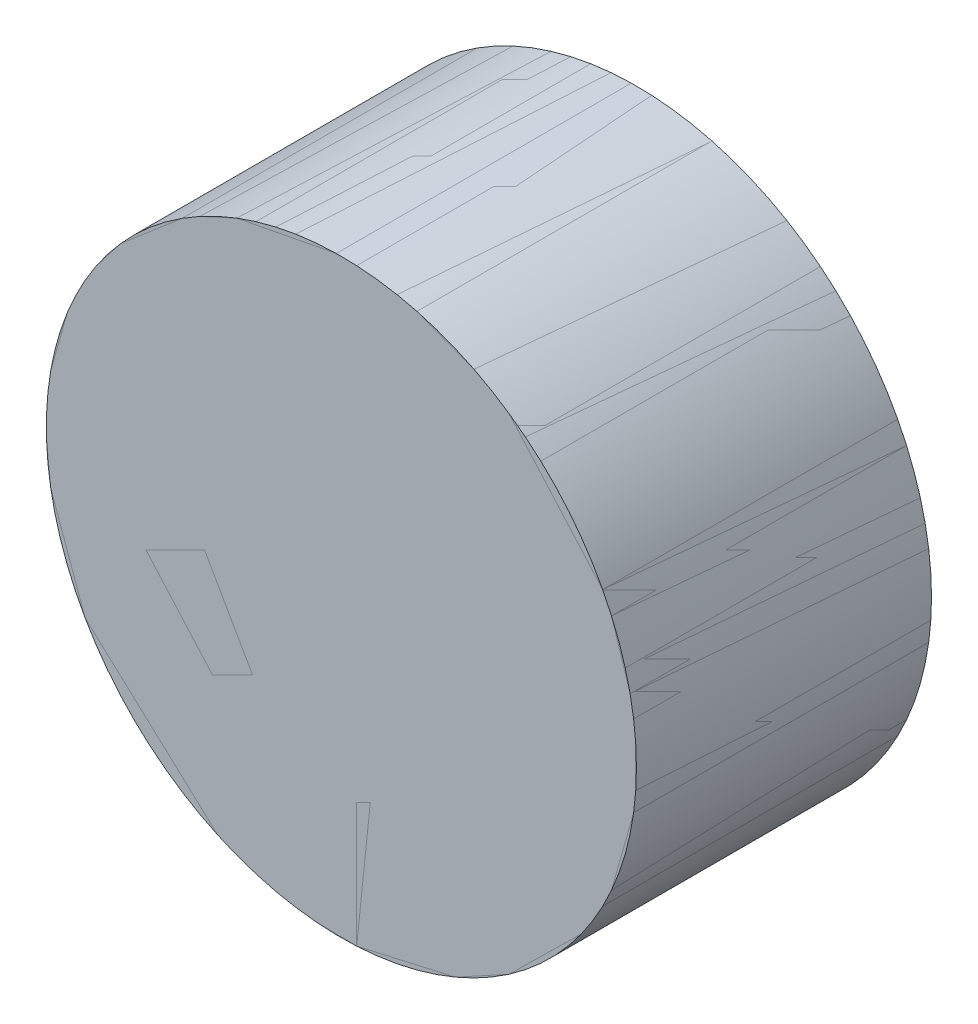
ISO-10303-21;
HEADER;
FILE_DESCRIPTION(('STEP AP214'),'2;1');
FILE_NAME('part.step','',(''),(''),'','','');
FILE_SCHEMA(('AUTOMOTIVE_DESIGN { 1 0 10303 214 1 1 1 1 }'));
ENDSEC;
DATA;
#1=APPLICATION_CONTEXT('core data for automotive mechanical design processes');
#2=APPLICATION_PROTOCOL_DEFINITION('international standard','automotive_design',2000,#1);
#3=PRODUCT_CONTEXT('',#1,'mechanical');
#4=PRODUCT('Part','Part','',(#3));
#5=PRODUCT_RELATED_PRODUCT_CATEGORY('part','',(#4));
#6=PRODUCT_DEFINITION_FORMATION('','',#4);
#7=PRODUCT_DEFINITION_CONTEXT('part definition',#1,'design');
#8=PRODUCT_DEFINITION('design','',#6,#7);
#9=PRODUCT_DEFINITION_SHAPE('','',#8);
#10=(LENGTH_UNIT() NAMED_UNIT(*) SI_UNIT(.MILLI.,.METRE.));
#11=(NAMED_UNIT(*) PLANE_ANGLE_UNIT() SI_UNIT($,.RADIAN.));
#12=(NAMED_UNIT(*) SI_UNIT($,.STERADIAN.) SOLID_ANGLE_UNIT());
#13=UNCERTAINTY_MEASURE_WITH_UNIT(LENGTH_MEASURE(1.E-05),#10,'distance_accuracy_value','');
#14=(GEOMETRIC_REPRESENTATION_CONTEXT(3) GLOBAL_UNCERTAINTY_ASSIGNED_CONTEXT((#13)) GLOBAL_UNIT_ASSIGNED_CONTEXT((#10,
#11,#12)) REPRESENTATION_CONTEXT('',''));
#15=CARTESIAN_POINT('',(0.,0.,0.));
#16=DIRECTION('',(0.,0.,1.));
#17=DIRECTION('',(1.,0.,0.));
#18=AXIS2_PLACEMENT_3D('',#15,#16,#17);
#19=CARTESIAN_POINT('',(0.,0.,5.));
#20=DIRECTION('',(0.,0.,-1.));
#21=DIRECTION('',(-1.,0.,0.));
#22=AXIS2_PLACEMENT_3D('',#19,#20,#21);
#23=CYLINDRICAL_SURFACE('',#22,10.);
#24=CARTESIAN_POINT('',(0.,0.,5.));
#25=DIRECTION('',(0.,0.,1.));
#26=DIRECTION('',(1.,0.,0.));
#27=AXIS2_PLACEMENT_3D('',#24,#25,#26);
#28=CIRCLE('',#27,10.);
#29=CARTESIAN_POINT('',(10.,0.,5.));
#30=VERTEX_POINT('',#29);
#31=EDGE_CURVE('E11',#30,#30,#28,.T.);
#32=ORIENTED_EDGE('',*,*,#31,.F.);
#33=EDGE_LOOP('',(#32));
#34=FACE_BOUND('',#33,.T.);
#35=CARTESIAN_POINT('',(0.,0.,-5.));
#36=DIRECTION('',(0.,0.,1.));
#37=DIRECTION('',(1.,0.,0.));
#38=AXIS2_PLACEMENT_3D('',#35,#36,#37);
#39=CIRCLE('',#38,10.);
#40=CARTESIAN_POINT('',(10.,0.,-5.));
#41=VERTEX_POINT('',#40);
#42=EDGE_CURVE('E48',#41,#41,#39,.T.);
#43=ORIENTED_EDGE('',*,*,#42,.T.);
#44=EDGE_LOOP('',(#43));
#45=FACE_BOUND('',#44,.T.);
#46=ADVANCED_FACE('F45',(#34,#45),#23,.T.);
#47=CARTESIAN_POINT('',(0.,0.,5.));
#48=DIRECTION('',(0.,0.,1.));
#49=DIRECTION('',(1.,0.,0.));
#50=AXIS2_PLACEMENT_3D('',#47,#48,#49);
#51=PLANE('',#50);
#52=ORIENTED_EDGE('',*,*,#31,.T.);
#53=EDGE_LOOP('',(#52));
#54=FACE_BOUND('',#53,.T.);
#55=ADVANCED_FACE('F60',(#54),#51,.T.);
#56=CARTESIAN_POINT('',(0.,0.,-5.));
#57=DIRECTION('',(0.,0.,1.));
#58=DIRECTION('',(1.,0.,0.));
#59=AXIS2_PLACEMENT_3D('',#56,#57,#58);
#60=PLANE('',#59);
#61=ORIENTED_EDGE('',*,*,#42,.F.);
#62=EDGE_LOOP('',(#61));
#63=FACE_BOUND('',#62,.T.);
#64=ADVANCED_FACE('F58',(#63),#60,.F.);
#65=CLOSED_SHELL('',(#46,#55,#64));
#66=MANIFOLD_SOLID_BREP('B2',#65);
#67=CARTESIAN_POINT('',(0.,0.,5.));
#68=DIRECTION('',(0.,0.,-1.));
#69=DIRECTION('',(-1.,0.,0.));
#70=AXIS2_PLACEMENT_3D('',#67,#68,#69);
#71=CYLINDRICAL_SURFACE('',#70,10.);
#72=CARTESIAN_POINT('',(0.,0.,5.));
#73=DIRECTION('',(0.,0.,1.));
#74=DIRECTION('',(1.,0.,0.));
#75=AXIS2_PLACEMENT_3D('',#72,#73,#74);
#76=CIRCLE('',#75,10.);
#77=CARTESIAN_POINT('',(10.,0.,5.));
#78=VERTEX_POINT('',#77);
#79=EDGE_CURVE('E44',#78,#78,#76,.T.);
#80=ORIENTED_EDGE('',*,*,#79,.F.);
#81=EDGE_LOOP('',(#80));
#82=FACE_BOUND('',#81,.T.);
#83=CARTESIAN_POINT('',(0.,0.,-5.));
#84=DIRECTION('',(0.,0.,1.));
#85=DIRECTION('',(1.,0.,0.));
#86=AXIS2_PLACEMENT_3D('',#83,#84,#85);
#87=CIRCLE('',#86,10.);
#88=CARTESIAN_POINT('',(10.,0.,-5.));
#89=VERTEX_POINT('',#88);
#90=EDGE_CURVE('E89',#89,#89,#87,.T.);
#91=ORIENTED_EDGE('',*,*,#90,.T.);
#92=EDGE_LOOP('',(#91));
#93=FACE_BOUND('',#92,.T.);
#94=ADVANCED_FACE('F86',(#82,#93),#71,.T.);
#95=CARTESIAN_POINT('',(0.,0.,5.));
#96=DIRECTION('',(0.,0.,1.));
#97=DIRECTION('',(1.,0.,0.));
#98=AXIS2_PLACEMENT_3D('',#95,#96,#97);
#99=PLANE('',#98);
#100=ORIENTED_EDGE('',*,*,#79,.T.);
#101=EDGE_LOOP('',(#100));
#102=FACE_BOUND('',#101,.T.);
#103=ADVANCED_FACE('F101',(#102),#99,.T.);
#104=CARTESIAN_POINT('',(0.,0.,-5.));
#105=DIRECTION('',(0.,0.,1.));
#106=DIRECTION('',(1.,0.,0.));
#107=AXIS2_PLACEMENT_3D('',#104,#105,#106);
#108=PLANE('',#107);
#109=ORIENTED_EDGE('',*,*,#90,.F.);
#110=EDGE_LOOP('',(#109));
#111=FACE_BOUND('',#110,.T.);
#112=ADVANCED_FACE('F99',(#111),#108,.F.);
#113=CLOSED_SHELL('',(#94,#103,#112));
#114=MANIFOLD_SOLID_BREP('B6',#113);
#115=ADVANCED_BREP_SHAPE_REPRESENTATION('',(#18,#66,#114),#14);
#116=SHAPE_DEFINITION_REPRESENTATION(#9,#115);
ENDSEC;
END-ISO-10303-21;
